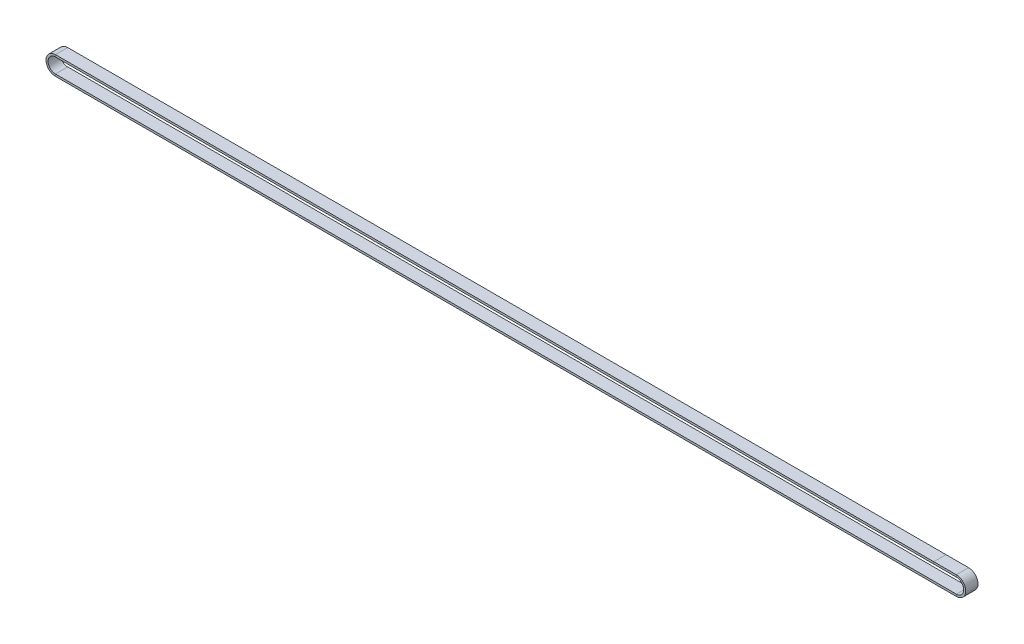
ISO-10303-21;
HEADER;
FILE_DESCRIPTION(('STEP AP214'),'2;1');
FILE_NAME('part.step','',(''),(''),'','','');
FILE_SCHEMA(('AUTOMOTIVE_DESIGN { 1 0 10303 214 1 1 1 1 }'));
ENDSEC;
DATA;
#1=APPLICATION_CONTEXT('core data for automotive mechanical design processes');
#2=APPLICATION_PROTOCOL_DEFINITION('international standard','automotive_design',2000,#1);
#3=PRODUCT_CONTEXT('',#1,'mechanical');
#4=PRODUCT('Part','Part','',(#3));
#5=PRODUCT_RELATED_PRODUCT_CATEGORY('part','',(#4));
#6=PRODUCT_DEFINITION_FORMATION('','',#4);
#7=PRODUCT_DEFINITION_CONTEXT('part definition',#1,'design');
#8=PRODUCT_DEFINITION('design','',#6,#7);
#9=PRODUCT_DEFINITION_SHAPE('','',#8);
#10=(LENGTH_UNIT() NAMED_UNIT(*) SI_UNIT(.MILLI.,.METRE.));
#11=(NAMED_UNIT(*) PLANE_ANGLE_UNIT() SI_UNIT($,.RADIAN.));
#12=(NAMED_UNIT(*) SI_UNIT($,.STERADIAN.) SOLID_ANGLE_UNIT());
#13=UNCERTAINTY_MEASURE_WITH_UNIT(LENGTH_MEASURE(1.E-05),#10,'distance_accuracy_value','');
#14=(GEOMETRIC_REPRESENTATION_CONTEXT(3) GLOBAL_UNCERTAINTY_ASSIGNED_CONTEXT((#13)) GLOBAL_UNIT_ASSIGNED_CONTEXT((#10,
#11,#12)) REPRESENTATION_CONTEXT('',''));
#15=CARTESIAN_POINT('',(0.,0.,0.));
#16=DIRECTION('',(0.,0.,1.));
#17=DIRECTION('',(1.,0.,0.));
#18=AXIS2_PLACEMENT_3D('',#15,#16,#17);
#19=CARTESIAN_POINT('',(-660.332653819074,6.89999999999992,0.));
#20=DIRECTION('',(0.,1.,0.));
#21=DIRECTION('',(-1.,0.,0.));
#22=AXIS2_PLACEMENT_3D('',#19,#20,#21);
#23=PLANE('',#22);
#24=DIRECTION('',(1.,0.,0.));
#25=VECTOR('',#24,1.);
#26=CARTESIAN_POINT('',(-660.332653819074,6.89999999999992,0.));
#27=LINE('',#26,#25);
#28=CARTESIAN_POINT('',(-660.332653819074,6.89999999999992,0.));
#29=VERTEX_POINT('',#28);
#30=CARTESIAN_POINT('',(-16.,6.90000000000021,0.));
#31=VERTEX_POINT('',#30);
#32=EDGE_CURVE('E11',#29,#31,#27,.T.);
#33=ORIENTED_EDGE('',*,*,#32,.F.);
#34=DIRECTION('',(0.,0.,1.));
#35=VECTOR('',#34,1.);
#36=CARTESIAN_POINT('',(-660.332653819074,6.89999999999992,0.));
#37=LINE('',#36,#35);
#38=CARTESIAN_POINT('',(-660.332653819074,6.89999999999992,9.));
#39=VERTEX_POINT('',#38);
#40=EDGE_CURVE('E38',#29,#39,#37,.T.);
#41=ORIENTED_EDGE('',*,*,#40,.T.);
#42=DIRECTION('',(1.,0.,0.));
#43=VECTOR('',#42,1.);
#44=CARTESIAN_POINT('',(-660.332653819074,6.89999999999992,9.));
#45=LINE('',#44,#43);
#46=CARTESIAN_POINT('',(-16.,6.90000000000021,9.));
#47=VERTEX_POINT('',#46);
#48=EDGE_CURVE('E126',#39,#47,#45,.T.);
#49=ORIENTED_EDGE('',*,*,#48,.T.);
#50=DIRECTION('',(0.,0.,1.));
#51=VECTOR('',#50,1.);
#52=CARTESIAN_POINT('',(-16.,6.90000000000021,0.));
#53=LINE('',#52,#51);
#54=EDGE_CURVE('E129',#31,#47,#53,.T.);
#55=ORIENTED_EDGE('',*,*,#54,.F.);
#56=EDGE_LOOP('',(#33,#41,#49,#55));
#57=FACE_BOUND('',#56,.T.);
#58=ADVANCED_FACE('F35',(#57),#23,.T.);
#59=CARTESIAN_POINT('',(-660.332653819074,6.89999999999992,0.));
#60=DIRECTION('',(0.,0.,-1.));
#61=DIRECTION('',(0.,1.,0.));
#62=AXIS2_PLACEMENT_3D('',#59,#60,#61);
#63=PLANE('',#62);
#64=DIRECTION('',(1.,0.,0.));
#65=VECTOR('',#64,1.);
#66=CARTESIAN_POINT('',(-660.332653819074,5.39999999999992,0.));
#67=LINE('',#66,#65);
#68=CARTESIAN_POINT('',(-660.332653819074,5.39999999999992,0.));
#69=VERTEX_POINT('',#68);
#70=CARTESIAN_POINT('',(-16.,5.40000000000021,0.));
#71=VERTEX_POINT('',#70);
#72=EDGE_CURVE('E43',#69,#71,#67,.T.);
#73=ORIENTED_EDGE('',*,*,#72,.F.);
#74=DIRECTION('',(0.,1.,0.));
#75=VECTOR('',#74,1.);
#76=CARTESIAN_POINT('',(-660.332653819074,6.89999999999992,0.));
#77=LINE('',#76,#75);
#78=EDGE_CURVE('E216',#69,#29,#77,.T.);
#79=ORIENTED_EDGE('',*,*,#78,.T.);
#80=ORIENTED_EDGE('',*,*,#32,.T.);
#81=DIRECTION('',(0.,1.,0.));
#82=VECTOR('',#81,1.);
#83=CARTESIAN_POINT('',(-16.,6.90000000000021,0.));
#84=LINE('',#83,#82);
#85=EDGE_CURVE('E154',#71,#31,#84,.T.);
#86=ORIENTED_EDGE('',*,*,#85,.F.);
#87=EDGE_LOOP('',(#73,#79,#80,#86));
#88=FACE_BOUND('',#87,.T.);
#89=ADVANCED_FACE('F263',(#88),#63,.T.);
#90=CARTESIAN_POINT('',(-660.332653819074,5.39999999999992,0.));
#91=DIRECTION('',(0.,-1.,0.));
#92=DIRECTION('',(1.,0.,0.));
#93=AXIS2_PLACEMENT_3D('',#90,#91,#92);
#94=PLANE('',#93);
#95=DIRECTION('',(1.,0.,0.));
#96=VECTOR('',#95,1.);
#97=CARTESIAN_POINT('',(-660.332653819074,5.39999999999992,9.));
#98=LINE('',#97,#96);
#99=CARTESIAN_POINT('',(-660.332653819074,5.39999999999992,9.));
#100=VERTEX_POINT('',#99);
#101=CARTESIAN_POINT('',(-16.,5.40000000000021,9.));
#102=VERTEX_POINT('',#101);
#103=EDGE_CURVE('E135',#100,#102,#98,.T.);
#104=ORIENTED_EDGE('',*,*,#103,.F.);
#105=DIRECTION('',(0.,0.,-1.));
#106=VECTOR('',#105,1.);
#107=CARTESIAN_POINT('',(-660.332653819074,5.39999999999992,0.));
#108=LINE('',#107,#106);
#109=EDGE_CURVE('E191',#100,#69,#108,.T.);
#110=ORIENTED_EDGE('',*,*,#109,.T.);
#111=ORIENTED_EDGE('',*,*,#72,.T.);
#112=DIRECTION('',(0.,0.,-1.));
#113=VECTOR('',#112,1.);
#114=CARTESIAN_POINT('',(-16.,5.40000000000021,0.));
#115=LINE('',#114,#113);
#116=EDGE_CURVE('E158',#102,#71,#115,.T.);
#117=ORIENTED_EDGE('',*,*,#116,.F.);
#118=EDGE_LOOP('',(#104,#110,#111,#117));
#119=FACE_BOUND('',#118,.T.);
#120=ADVANCED_FACE('F267',(#119),#94,.T.);
#121=CARTESIAN_POINT('',(-660.332653819074,0.,0.));
#122=DIRECTION('',(0.,0.,-1.));
#123=DIRECTION('',(-1.,0.,0.));
#124=AXIS2_PLACEMENT_3D('',#121,#122,#123);
#125=CYLINDRICAL_SURFACE('',#124,6.90000000000001);
#126=ORIENTED_EDGE('',*,*,#40,.F.);
#127=CARTESIAN_POINT('',(-660.332653819074,0.,0.));
#128=DIRECTION('',(0.,0.,-1.));
#129=DIRECTION('',(0.,-1.,0.));
#130=AXIS2_PLACEMENT_3D('',#127,#128,#129);
#131=CIRCLE('',#130,6.90000000000001);
#132=CARTESIAN_POINT('',(-660.332653819074,-6.90000000000009,0.));
#133=VERTEX_POINT('',#132);
#134=EDGE_CURVE('E230',#133,#29,#131,.T.);
#135=ORIENTED_EDGE('',*,*,#134,.F.);
#136=DIRECTION('',(0.,0.,1.));
#137=VECTOR('',#136,1.);
#138=CARTESIAN_POINT('',(-660.332653819074,-6.90000000000009,0.));
#139=LINE('',#138,#137);
#140=CARTESIAN_POINT('',(-660.332653819074,-6.90000000000009,9.));
#141=VERTEX_POINT('',#140);
#142=EDGE_CURVE('E194',#133,#141,#139,.T.);
#143=ORIENTED_EDGE('',*,*,#142,.T.);
#144=CARTESIAN_POINT('',(-660.332653819074,0.,9.));
#145=DIRECTION('',(0.,0.,-1.));
#146=DIRECTION('',(0.,-1.,0.));
#147=AXIS2_PLACEMENT_3D('',#144,#145,#146);
#148=CIRCLE('',#147,6.90000000000001);
#149=EDGE_CURVE('E188',#141,#39,#148,.T.);
#150=ORIENTED_EDGE('',*,*,#149,.T.);
#151=EDGE_LOOP('',(#126,#135,#143,#150));
#152=FACE_BOUND('',#151,.T.);
#153=ADVANCED_FACE('F239',(#152),#125,.T.);
#154=CARTESIAN_POINT('',(-660.332653819074,-6.90000000000009,0.));
#155=DIRECTION('',(0.,0.,-1.));
#156=DIRECTION('',(-1.,0.,0.));
#157=AXIS2_PLACEMENT_3D('',#154,#155,#156);
#158=PLANE('',#157);
#159=ORIENTED_EDGE('',*,*,#134,.T.);
#160=ORIENTED_EDGE('',*,*,#78,.F.);
#161=CARTESIAN_POINT('',(-660.332653819074,0.,0.));
#162=DIRECTION('',(0.,0.,-1.));
#163=DIRECTION('',(0.,-1.,0.));
#164=AXIS2_PLACEMENT_3D('',#161,#162,#163);
#165=CIRCLE('',#164,5.40000000000001);
#166=CARTESIAN_POINT('',(-660.332653819074,-5.40000000000009,0.));
#167=VERTEX_POINT('',#166);
#168=EDGE_CURVE('E213',#167,#69,#165,.T.);
#169=ORIENTED_EDGE('',*,*,#168,.F.);
#170=DIRECTION('',(0.,-1.,0.));
#171=VECTOR('',#170,1.);
#172=CARTESIAN_POINT('',(-660.332653819074,-6.90000000000009,0.));
#173=LINE('',#172,#171);
#174=EDGE_CURVE('E209',#167,#133,#173,.T.);
#175=ORIENTED_EDGE('',*,*,#174,.T.);
#176=EDGE_LOOP('',(#159,#160,#169,#175));
#177=FACE_BOUND('',#176,.T.);
#178=ADVANCED_FACE('F276',(#177),#158,.T.);
#179=CARTESIAN_POINT('',(-660.332653819074,0.,0.));
#180=DIRECTION('',(0.,0.,-1.));
#181=DIRECTION('',(-1.,0.,0.));
#182=AXIS2_PLACEMENT_3D('',#179,#180,#181);
#183=CYLINDRICAL_SURFACE('',#182,5.40000000000001);
#184=ORIENTED_EDGE('',*,*,#168,.T.);
#185=ORIENTED_EDGE('',*,*,#109,.F.);
#186=CARTESIAN_POINT('',(-660.332653819074,0.,9.));
#187=DIRECTION('',(0.,0.,-1.));
#188=DIRECTION('',(0.,-1.,0.));
#189=AXIS2_PLACEMENT_3D('',#186,#187,#188);
#190=CIRCLE('',#189,5.40000000000001);
#191=CARTESIAN_POINT('',(-660.332653819074,-5.40000000000009,9.));
#192=VERTEX_POINT('',#191);
#193=EDGE_CURVE('E187',#192,#100,#190,.T.);
#194=ORIENTED_EDGE('',*,*,#193,.F.);
#195=DIRECTION('',(0.,0.,-1.));
#196=VECTOR('',#195,1.);
#197=CARTESIAN_POINT('',(-660.332653819074,-5.40000000000009,0.));
#198=LINE('',#197,#196);
#199=EDGE_CURVE('E180',#192,#167,#198,.T.);
#200=ORIENTED_EDGE('',*,*,#199,.T.);
#201=EDGE_LOOP('',(#184,#185,#194,#200));
#202=FACE_BOUND('',#201,.T.);
#203=ADVANCED_FACE('F247',(#202),#183,.F.);
#204=CARTESIAN_POINT('',(-660.332653819074,-6.90000000000009,9.));
#205=DIRECTION('',(0.,0.,1.));
#206=DIRECTION('',(1.,0.,0.));
#207=AXIS2_PLACEMENT_3D('',#204,#205,#206);
#208=PLANE('',#207);
#209=ORIENTED_EDGE('',*,*,#193,.T.);
#210=DIRECTION('',(0.,-1.,0.));
#211=VECTOR('',#210,1.);
#212=CARTESIAN_POINT('',(-660.332653819074,6.89999999999992,9.));
#213=LINE('',#212,#211);
#214=EDGE_CURVE('E185',#39,#100,#213,.T.);
#215=ORIENTED_EDGE('',*,*,#214,.F.);
#216=ORIENTED_EDGE('',*,*,#149,.F.);
#217=DIRECTION('',(0.,1.,0.));
#218=VECTOR('',#217,1.);
#219=CARTESIAN_POINT('',(-660.332653819074,-6.90000000000009,9.));
#220=LINE('',#219,#218);
#221=EDGE_CURVE('E177',#141,#192,#220,.T.);
#222=ORIENTED_EDGE('',*,*,#221,.T.);
#223=EDGE_LOOP('',(#209,#215,#216,#222));
#224=FACE_BOUND('',#223,.T.);
#225=ADVANCED_FACE('F244',(#224),#208,.T.);
#226=CARTESIAN_POINT('',(0.599999999999334,-6.8999999999998,0.));
#227=DIRECTION('',(0.,-1.,0.));
#228=DIRECTION('',(1.,0.,0.));
#229=AXIS2_PLACEMENT_3D('',#226,#227,#228);
#230=PLANE('',#229);
#231=ORIENTED_EDGE('',*,*,#142,.F.);
#232=DIRECTION('',(-1.,0.,0.));
#233=VECTOR('',#232,1.);
#234=CARTESIAN_POINT('',(0.599999999999334,-6.8999999999998,0.));
#235=LINE('',#234,#233);
#236=CARTESIAN_POINT('',(0.599999999999335,-6.8999999999997,0.));
#237=VERTEX_POINT('',#236);
#238=EDGE_CURVE('E84',#237,#133,#235,.T.);
#239=ORIENTED_EDGE('',*,*,#238,.F.);
#240=DIRECTION('',(0.,0.,1.));
#241=VECTOR('',#240,1.);
#242=CARTESIAN_POINT('',(0.599999999999332,-6.8999999999998,0.));
#243=LINE('',#242,#241);
#244=CARTESIAN_POINT('',(0.599999999999335,-6.8999999999997,9.));
#245=VERTEX_POINT('',#244);
#246=EDGE_CURVE('E184',#237,#245,#243,.T.);
#247=ORIENTED_EDGE('',*,*,#246,.T.);
#248=DIRECTION('',(-1.,0.,0.));
#249=VECTOR('',#248,1.);
#250=CARTESIAN_POINT('',(0.599999999999334,-6.8999999999998,9.));
#251=LINE('',#250,#249);
#252=EDGE_CURVE('E182',#245,#141,#251,.T.);
#253=ORIENTED_EDGE('',*,*,#252,.T.);
#254=EDGE_LOOP('',(#231,#239,#247,#253));
#255=FACE_BOUND('',#254,.T.);
#256=ADVANCED_FACE('F258',(#255),#230,.T.);
#257=CARTESIAN_POINT('',(0.599999999999334,-6.8999999999998,0.));
#258=DIRECTION('',(0.,0.,-1.));
#259=DIRECTION('',(0.,1.,0.));
#260=AXIS2_PLACEMENT_3D('',#257,#258,#259);
#261=PLANE('',#260);
#262=ORIENTED_EDGE('',*,*,#238,.T.);
#263=ORIENTED_EDGE('',*,*,#174,.F.);
#264=DIRECTION('',(-1.,0.,0.));
#265=VECTOR('',#264,1.);
#266=CARTESIAN_POINT('',(0.599999999999334,-5.3999999999998,0.));
#267=LINE('',#266,#265);
#268=CARTESIAN_POINT('',(0.599999999999338,-5.3999999999997,0.));
#269=VERTEX_POINT('',#268);
#270=EDGE_CURVE('E94',#269,#167,#267,.T.);
#271=ORIENTED_EDGE('',*,*,#270,.F.);
#272=DIRECTION('',(0.,-1.,0.));
#273=VECTOR('',#272,1.);
#274=CARTESIAN_POINT('',(0.599999999999332,-6.8999999999998,0.));
#275=LINE('',#274,#273);
#276=EDGE_CURVE('E206',#269,#237,#275,.T.);
#277=ORIENTED_EDGE('',*,*,#276,.T.);
#278=EDGE_LOOP('',(#262,#263,#271,#277));
#279=FACE_BOUND('',#278,.T.);
#280=ADVANCED_FACE('F250',(#279),#261,.T.);
#281=CARTESIAN_POINT('',(0.599999999999334,-5.3999999999998,0.));
#282=DIRECTION('',(0.,1.,0.));
#283=DIRECTION('',(-1.,0.,0.));
#284=AXIS2_PLACEMENT_3D('',#281,#282,#283);
#285=PLANE('',#284);
#286=ORIENTED_EDGE('',*,*,#270,.T.);
#287=ORIENTED_EDGE('',*,*,#199,.F.);
#288=DIRECTION('',(-1.,0.,0.));
#289=VECTOR('',#288,1.);
#290=CARTESIAN_POINT('',(0.599999999999334,-5.3999999999998,9.));
#291=LINE('',#290,#289);
#292=CARTESIAN_POINT('',(0.599999999999338,-5.3999999999997,9.));
#293=VERTEX_POINT('',#292);
#294=EDGE_CURVE('E102',#293,#192,#291,.T.);
#295=ORIENTED_EDGE('',*,*,#294,.F.);
#296=DIRECTION('',(0.,0.,-1.));
#297=VECTOR('',#296,1.);
#298=CARTESIAN_POINT('',(0.599999999999335,-5.3999999999998,0.));
#299=LINE('',#298,#297);
#300=EDGE_CURVE('E173',#293,#269,#299,.T.);
#301=ORIENTED_EDGE('',*,*,#300,.T.);
#302=EDGE_LOOP('',(#286,#287,#295,#301));
#303=FACE_BOUND('',#302,.T.);
#304=ADVANCED_FACE('F248',(#303),#285,.T.);
#305=CARTESIAN_POINT('',(0.599999999999334,-6.8999999999998,9.));
#306=DIRECTION('',(0.,0.,1.));
#307=DIRECTION('',(1.,0.,0.));
#308=AXIS2_PLACEMENT_3D('',#305,#306,#307);
#309=PLANE('',#308);
#310=ORIENTED_EDGE('',*,*,#294,.T.);
#311=ORIENTED_EDGE('',*,*,#221,.F.);
#312=ORIENTED_EDGE('',*,*,#252,.F.);
#313=DIRECTION('',(0.,1.,0.));
#314=VECTOR('',#313,1.);
#315=CARTESIAN_POINT('',(0.599999999999332,-6.8999999999998,9.));
#316=LINE('',#315,#314);
#317=EDGE_CURVE('E167',#245,#293,#316,.T.);
#318=ORIENTED_EDGE('',*,*,#317,.T.);
#319=EDGE_LOOP('',(#310,#311,#312,#318));
#320=FACE_BOUND('',#319,.T.);
#321=ADVANCED_FACE('F242',(#320),#309,.T.);
#322=CARTESIAN_POINT('',(0.599999999999344,2.08166817117217E-13,0.));
#323=DIRECTION('',(0.,0.,-1.));
#324=DIRECTION('',(-1.,0.,0.));
#325=AXIS2_PLACEMENT_3D('',#322,#323,#324);
#326=CYLINDRICAL_SURFACE('',#325,6.89999999999991);
#327=ORIENTED_EDGE('',*,*,#246,.F.);
#328=CARTESIAN_POINT('',(0.599999999999344,2.08166817117217E-13,0.));
#329=DIRECTION('',(0.,0.,-1.));
#330=DIRECTION('',(0.,1.,0.));
#331=AXIS2_PLACEMENT_3D('',#328,#329,#330);
#332=CIRCLE('',#331,6.89999999999991);
#333=CARTESIAN_POINT('',(0.599999999999393,6.90000000000022,0.));
#334=VERTEX_POINT('',#333);
#335=EDGE_CURVE('E223',#334,#237,#332,.T.);
#336=ORIENTED_EDGE('',*,*,#335,.F.);
#337=DIRECTION('',(0.,0.,1.));
#338=VECTOR('',#337,1.);
#339=CARTESIAN_POINT('',(0.599999999999393,6.90000000000022,0.));
#340=LINE('',#339,#338);
#341=CARTESIAN_POINT('',(0.599999999999393,6.90000000000022,9.));
#342=VERTEX_POINT('',#341);
#343=EDGE_CURVE('E176',#334,#342,#340,.T.);
#344=ORIENTED_EDGE('',*,*,#343,.T.);
#345=CARTESIAN_POINT('',(0.599999999999344,2.08166817117217E-13,9.));
#346=DIRECTION('',(0.,0.,-1.));
#347=DIRECTION('',(0.,1.,0.));
#348=AXIS2_PLACEMENT_3D('',#345,#346,#347);
#349=CIRCLE('',#348,6.89999999999991);
#350=EDGE_CURVE('E170',#342,#245,#349,.T.);
#351=ORIENTED_EDGE('',*,*,#350,.T.);
#352=EDGE_LOOP('',(#327,#336,#344,#351));
#353=FACE_BOUND('',#352,.T.);
#354=ADVANCED_FACE('F256',(#353),#326,.T.);
#355=CARTESIAN_POINT('',(0.599999999999351,6.90000000000012,0.));
#356=DIRECTION('',(0.,0.,-1.));
#357=DIRECTION('',(-1.,0.,0.));
#358=AXIS2_PLACEMENT_3D('',#355,#356,#357);
#359=PLANE('',#358);
#360=ORIENTED_EDGE('',*,*,#335,.T.);
#361=ORIENTED_EDGE('',*,*,#276,.F.);
#362=CARTESIAN_POINT('',(0.599999999999344,2.08166817117217E-13,0.));
#363=DIRECTION('',(0.,0.,-1.));
#364=DIRECTION('',(0.,1.,0.));
#365=AXIS2_PLACEMENT_3D('',#362,#363,#364);
#366=CIRCLE('',#365,5.39999999999991);
#367=CARTESIAN_POINT('',(0.599999999999393,5.40000000000022,0.));
#368=VERTEX_POINT('',#367);
#369=EDGE_CURVE('E203',#368,#269,#366,.T.);
#370=ORIENTED_EDGE('',*,*,#369,.F.);
#371=DIRECTION('',(0.,1.,0.));
#372=VECTOR('',#371,1.);
#373=CARTESIAN_POINT('',(0.599999999999393,6.90000000000022,0.));
#374=LINE('',#373,#372);
#375=EDGE_CURVE('E201',#368,#334,#374,.T.);
#376=ORIENTED_EDGE('',*,*,#375,.T.);
#377=EDGE_LOOP('',(#360,#361,#370,#376));
#378=FACE_BOUND('',#377,.T.);
#379=ADVANCED_FACE('F283',(#378),#359,.T.);
#380=CARTESIAN_POINT('',(0.599999999999344,2.08166817117217E-13,0.));
#381=DIRECTION('',(0.,0.,-1.));
#382=DIRECTION('',(-1.,0.,0.));
#383=AXIS2_PLACEMENT_3D('',#380,#381,#382);
#384=CYLINDRICAL_SURFACE('',#383,5.39999999999991);
#385=ORIENTED_EDGE('',*,*,#369,.T.);
#386=ORIENTED_EDGE('',*,*,#300,.F.);
#387=CARTESIAN_POINT('',(0.599999999999344,2.08166817117217E-13,9.));
#388=DIRECTION('',(0.,0.,-1.));
#389=DIRECTION('',(0.,1.,0.));
#390=AXIS2_PLACEMENT_3D('',#387,#388,#389);
#391=CIRCLE('',#390,5.39999999999991);
#392=CARTESIAN_POINT('',(0.599999999999393,5.40000000000021,9.));
#393=VERTEX_POINT('',#392);
#394=EDGE_CURVE('E169',#393,#293,#391,.T.);
#395=ORIENTED_EDGE('',*,*,#394,.F.);
#396=DIRECTION('',(0.,0.,-1.));
#397=VECTOR('',#396,1.);
#398=CARTESIAN_POINT('',(0.599999999999393,5.40000000000022,0.));
#399=LINE('',#398,#397);
#400=EDGE_CURVE('E165',#393,#368,#399,.T.);
#401=ORIENTED_EDGE('',*,*,#400,.T.);
#402=EDGE_LOOP('',(#385,#386,#395,#401));
#403=FACE_BOUND('',#402,.T.);
#404=ADVANCED_FACE('F303',(#403),#384,.F.);
#405=CARTESIAN_POINT('',(0.599999999999351,6.90000000000012,9.));
#406=DIRECTION('',(0.,0.,1.));
#407=DIRECTION('',(1.,0.,0.));
#408=AXIS2_PLACEMENT_3D('',#405,#406,#407);
#409=PLANE('',#408);
#410=ORIENTED_EDGE('',*,*,#394,.T.);
#411=ORIENTED_EDGE('',*,*,#317,.F.);
#412=ORIENTED_EDGE('',*,*,#350,.F.);
#413=DIRECTION('',(0.,-1.,0.));
#414=VECTOR('',#413,1.);
#415=CARTESIAN_POINT('',(0.599999999999393,6.90000000000022,9.));
#416=LINE('',#415,#414);
#417=EDGE_CURVE('E146',#342,#393,#416,.T.);
#418=ORIENTED_EDGE('',*,*,#417,.T.);
#419=EDGE_LOOP('',(#410,#411,#412,#418));
#420=FACE_BOUND('',#419,.T.);
#421=ADVANCED_FACE('F280',(#420),#409,.T.);
#422=CARTESIAN_POINT('',(-16.,6.90000000000021,0.));
#423=DIRECTION('',(0.,1.,0.));
#424=DIRECTION('',(-1.,0.,0.));
#425=AXIS2_PLACEMENT_3D('',#422,#423,#424);
#426=PLANE('',#425);
#427=ORIENTED_EDGE('',*,*,#343,.F.);
#428=DIRECTION('',(1.,0.,0.));
#429=VECTOR('',#428,1.);
#430=CARTESIAN_POINT('',(-16.,6.90000000000021,0.));
#431=LINE('',#430,#429);
#432=EDGE_CURVE('E153',#31,#334,#431,.T.);
#433=ORIENTED_EDGE('',*,*,#432,.F.);
#434=ORIENTED_EDGE('',*,*,#54,.T.);
#435=DIRECTION('',(1.,0.,0.));
#436=VECTOR('',#435,1.);
#437=CARTESIAN_POINT('',(-16.,6.90000000000021,9.));
#438=LINE('',#437,#436);
#439=EDGE_CURVE('E141',#47,#342,#438,.T.);
#440=ORIENTED_EDGE('',*,*,#439,.T.);
#441=EDGE_LOOP('',(#427,#433,#434,#440));
#442=FACE_BOUND('',#441,.T.);
#443=ADVANCED_FACE('F151',(#442),#426,.T.);
#444=CARTESIAN_POINT('',(-16.,6.90000000000021,0.));
#445=DIRECTION('',(0.,0.,-1.));
#446=DIRECTION('',(0.,1.,0.));
#447=AXIS2_PLACEMENT_3D('',#444,#445,#446);
#448=PLANE('',#447);
#449=ORIENTED_EDGE('',*,*,#432,.T.);
#450=ORIENTED_EDGE('',*,*,#375,.F.);
#451=DIRECTION('',(1.,0.,0.));
#452=VECTOR('',#451,1.);
#453=CARTESIAN_POINT('',(-16.,5.40000000000021,0.));
#454=LINE('',#453,#452);
#455=EDGE_CURVE('E198',#71,#368,#454,.T.);
#456=ORIENTED_EDGE('',*,*,#455,.F.);
#457=ORIENTED_EDGE('',*,*,#85,.T.);
#458=EDGE_LOOP('',(#449,#450,#456,#457));
#459=FACE_BOUND('',#458,.T.);
#460=ADVANCED_FACE('F279',(#459),#448,.T.);
#461=CARTESIAN_POINT('',(-16.,5.40000000000021,0.));
#462=DIRECTION('',(0.,-1.,0.));
#463=DIRECTION('',(1.,0.,0.));
#464=AXIS2_PLACEMENT_3D('',#461,#462,#463);
#465=PLANE('',#464);
#466=ORIENTED_EDGE('',*,*,#455,.T.);
#467=ORIENTED_EDGE('',*,*,#400,.F.);
#468=DIRECTION('',(1.,0.,0.));
#469=VECTOR('',#468,1.);
#470=CARTESIAN_POINT('',(-16.,5.40000000000021,9.));
#471=LINE('',#470,#469);
#472=EDGE_CURVE('E164',#102,#393,#471,.T.);
#473=ORIENTED_EDGE('',*,*,#472,.F.);
#474=ORIENTED_EDGE('',*,*,#116,.T.);
#475=EDGE_LOOP('',(#466,#467,#473,#474));
#476=FACE_BOUND('',#475,.T.);
#477=ADVANCED_FACE('F298',(#476),#465,.T.);
#478=CARTESIAN_POINT('',(-16.,6.90000000000021,9.));
#479=DIRECTION('',(0.,0.,1.));
#480=DIRECTION('',(1.,0.,0.));
#481=AXIS2_PLACEMENT_3D('',#478,#479,#480);
#482=PLANE('',#481);
#483=ORIENTED_EDGE('',*,*,#472,.T.);
#484=ORIENTED_EDGE('',*,*,#417,.F.);
#485=ORIENTED_EDGE('',*,*,#439,.F.);
#486=DIRECTION('',(0.,-1.,0.));
#487=VECTOR('',#486,1.);
#488=CARTESIAN_POINT('',(-16.,6.90000000000021,9.));
#489=LINE('',#488,#487);
#490=EDGE_CURVE('E144',#47,#102,#489,.T.);
#491=ORIENTED_EDGE('',*,*,#490,.T.);
#492=EDGE_LOOP('',(#483,#484,#485,#491));
#493=FACE_BOUND('',#492,.T.);
#494=ADVANCED_FACE('F143',(#493),#482,.T.);
#495=CARTESIAN_POINT('',(-660.332653819074,6.89999999999992,9.));
#496=DIRECTION('',(0.,0.,1.));
#497=DIRECTION('',(1.,0.,0.));
#498=AXIS2_PLACEMENT_3D('',#495,#496,#497);
#499=PLANE('',#498);
#500=ORIENTED_EDGE('',*,*,#214,.T.);
#501=ORIENTED_EDGE('',*,*,#103,.T.);
#502=ORIENTED_EDGE('',*,*,#490,.F.);
#503=ORIENTED_EDGE('',*,*,#48,.F.);
#504=EDGE_LOOP('',(#500,#501,#502,#503));
#505=FACE_BOUND('',#504,.T.);
#506=ADVANCED_FACE('F156',(#505),#499,.T.);
#507=CLOSED_SHELL('',(#58,#89,#120,#153,#178,#203,#225,#256,#280,#304,#321,#354,#379,#404,#421,
#443,#460,#477,#494,#506));
#508=MANIFOLD_SOLID_BREP('B2',#507);
#509=ADVANCED_BREP_SHAPE_REPRESENTATION('',(#18,#508),#14);
#510=SHAPE_DEFINITION_REPRESENTATION(#9,#509);
ENDSEC;
END-ISO-10303-21;
